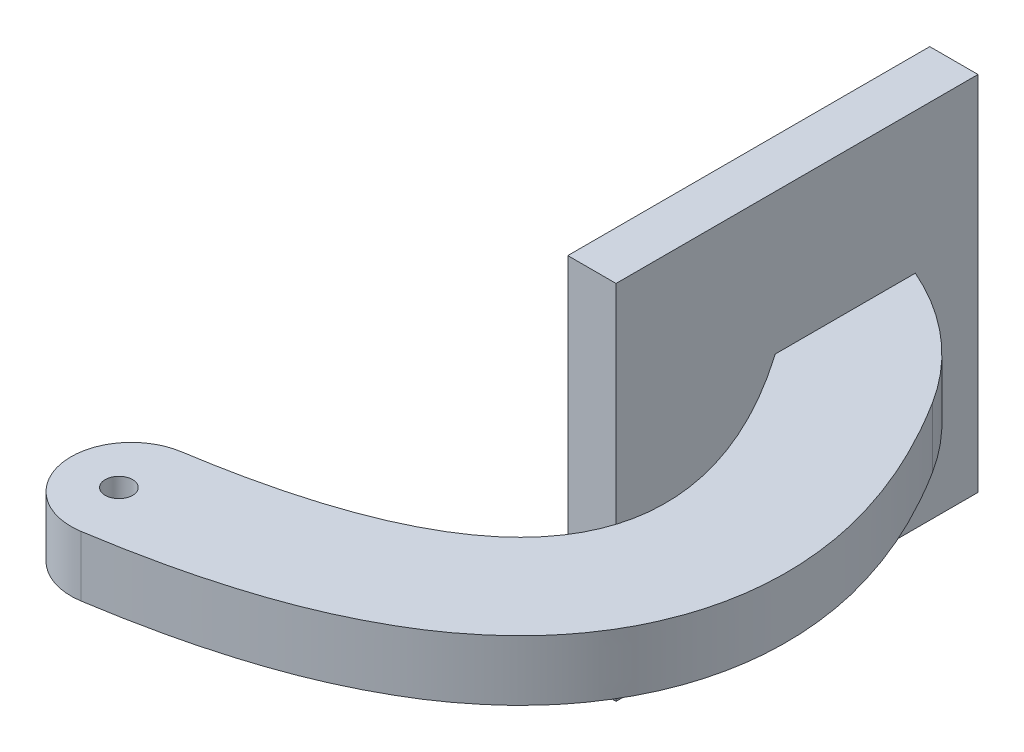
ISO-10303-21;
HEADER;
FILE_DESCRIPTION(('STEP AP214'),'2;1');
FILE_NAME('part.step','',(''),(''),'','','');
FILE_SCHEMA(('AUTOMOTIVE_DESIGN { 1 0 10303 214 1 1 1 1 }'));
ENDSEC;
DATA;
#1=APPLICATION_CONTEXT('core data for automotive mechanical design processes');
#2=APPLICATION_PROTOCOL_DEFINITION('international standard','automotive_design',2000,#1);
#3=PRODUCT_CONTEXT('',#1,'mechanical');
#4=PRODUCT('Part','Part','',(#3));
#5=PRODUCT_RELATED_PRODUCT_CATEGORY('part','',(#4));
#6=PRODUCT_DEFINITION_FORMATION('','',#4);
#7=PRODUCT_DEFINITION_CONTEXT('part definition',#1,'design');
#8=PRODUCT_DEFINITION('design','',#6,#7);
#9=PRODUCT_DEFINITION_SHAPE('','',#8);
#10=(LENGTH_UNIT() NAMED_UNIT(*) SI_UNIT(.MILLI.,.METRE.));
#11=(NAMED_UNIT(*) PLANE_ANGLE_UNIT() SI_UNIT($,.RADIAN.));
#12=(NAMED_UNIT(*) SI_UNIT($,.STERADIAN.) SOLID_ANGLE_UNIT());
#13=UNCERTAINTY_MEASURE_WITH_UNIT(LENGTH_MEASURE(1.E-05),#10,'distance_accuracy_value','');
#14=(GEOMETRIC_REPRESENTATION_CONTEXT(3) GLOBAL_UNCERTAINTY_ASSIGNED_CONTEXT((#13)) GLOBAL_UNIT_ASSIGNED_CONTEXT((#10,
#11,#12)) REPRESENTATION_CONTEXT('',''));
#15=CARTESIAN_POINT('',(0.,0.,0.));
#16=DIRECTION('',(0.,0.,1.));
#17=DIRECTION('',(1.,0.,0.));
#18=AXIS2_PLACEMENT_3D('',#15,#16,#17);
#19=CARTESIAN_POINT('',(12.2998460553788,-2.5,-15.4348897196174));
#20=CARTESIAN_POINT('',(30.5340209937318,-2.5,10.6094243612834));
#21=CARTESIAN_POINT('',(-5.28178022993747,-2.5,16.1860117987063));
#22=B_SPLINE_CURVE_WITH_KNOTS('',2,(#19,#20,#21),.UNSPECIFIED.,.F.,.F.,(3,3),(0.,1.),.UNSPECIFIED.);
#23=DIRECTION('',(0.,1.,0.));
#24=VECTOR('',#23,1.);
#25=SURFACE_OF_LINEAR_EXTRUSION('',#22,#24);
#26=DIRECTION('',(0.,1.,0.));
#27=VECTOR('',#26,1.);
#28=CARTESIAN_POINT('',(-5.28178022993747,-2.5,16.1860117987063));
#29=LINE('',#28,#27);
#30=CARTESIAN_POINT('',(-5.28178022993747,-2.5,16.1860117987063));
#31=VERTEX_POINT('',#30);
#32=CARTESIAN_POINT('',(-5.28178022993747,2.5,16.1860117987063));
#33=VERTEX_POINT('',#32);
#34=EDGE_CURVE('E38',#31,#33,#29,.T.);
#35=ORIENTED_EDGE('',*,*,#34,.T.);
#36=CARTESIAN_POINT('',(12.2998460553788,2.5,-15.4348897196174));
#37=CARTESIAN_POINT('',(30.5340209937318,2.5,10.6094243612834));
#38=CARTESIAN_POINT('',(-5.28178022993747,2.5,16.1860117987063));
#39=B_SPLINE_CURVE_WITH_KNOTS('',2,(#36,#37,#38),.UNSPECIFIED.,.F.,.F.,(3,3),(0.,1.),.UNSPECIFIED.);
#40=CARTESIAN_POINT('',(12.2998460553788,2.5,-15.4348897196174));
#41=VERTEX_POINT('',#40);
#42=EDGE_CURVE('E133',#41,#33,#39,.T.);
#43=ORIENTED_EDGE('',*,*,#42,.F.);
#44=DIRECTION('',(0.,1.,0.));
#45=VECTOR('',#44,1.);
#46=CARTESIAN_POINT('',(12.2998460553788,-2.5,-15.4348897196174));
#47=LINE('',#46,#45);
#48=CARTESIAN_POINT('',(12.2998460553788,-2.5,-15.4348897196174));
#49=VERTEX_POINT('',#48);
#50=EDGE_CURVE('E11',#49,#41,#47,.T.);
#51=ORIENTED_EDGE('',*,*,#50,.F.);
#52=EDGE_CURVE('E162',#49,#31,#22,.T.);
#53=ORIENTED_EDGE('',*,*,#52,.T.);
#54=EDGE_LOOP('',(#35,#43,#51,#53));
#55=FACE_BOUND('',#54,.T.);
#56=ADVANCED_FACE('F34',(#55),#25,.T.);
#57=CARTESIAN_POINT('',(3.36644101936229,-2.5,-6.50084250987972));
#58=DIRECTION('',(0.,1.,0.));
#59=DIRECTION('',(0.,0.,1.));
#60=AXIS2_PLACEMENT_3D('',#57,#58,#59);
#61=CYLINDRICAL_SURFACE('',#60,22.4003979095357);
#62=DIRECTION('',(0.,1.,0.));
#63=VECTOR('',#62,1.);
#64=CARTESIAN_POINT('',(12.2998460553788,-2.5,-27.0428020310161));
#65=LINE('',#64,#63);
#66=CARTESIAN_POINT('',(12.2998460553788,-2.5,-27.0428020310161));
#67=VERTEX_POINT('',#66);
#68=CARTESIAN_POINT('',(12.2998460553788,2.5,-27.0428020310161));
#69=VERTEX_POINT('',#68);
#70=EDGE_CURVE('E43',#67,#69,#65,.T.);
#71=ORIENTED_EDGE('',*,*,#70,.T.);
#72=CARTESIAN_POINT('',(3.36644101936229,2.5,-6.50084250987972));
#73=DIRECTION('',(0.,1.,0.));
#74=DIRECTION('',(0.,0.,1.));
#75=AXIS2_PLACEMENT_3D('',#72,#73,#74);
#76=CIRCLE('',#75,22.4003979095357);
#77=CARTESIAN_POINT('',(22.3170477174932,2.5,-18.4445576889305));
#78=VERTEX_POINT('',#77);
#79=EDGE_CURVE('E154',#78,#69,#76,.T.);
#80=ORIENTED_EDGE('',*,*,#79,.F.);
#81=DIRECTION('',(0.,1.,0.));
#82=VECTOR('',#81,1.);
#83=CARTESIAN_POINT('',(22.3170477174932,-2.5,-18.4445576889305));
#84=LINE('',#83,#82);
#85=CARTESIAN_POINT('',(22.3170477174932,-2.5,-18.4445576889305));
#86=VERTEX_POINT('',#85);
#87=EDGE_CURVE('E51',#86,#78,#84,.T.);
#88=ORIENTED_EDGE('',*,*,#87,.F.);
#89=CARTESIAN_POINT('',(3.36644101936229,-2.5,-6.50084250987972));
#90=DIRECTION('',(0.,1.,0.));
#91=DIRECTION('',(0.,0.,1.));
#92=AXIS2_PLACEMENT_3D('',#89,#90,#91);
#93=CIRCLE('',#92,22.4003979095357);
#94=EDGE_CURVE('E179',#86,#67,#93,.T.);
#95=ORIENTED_EDGE('',*,*,#94,.T.);
#96=EDGE_LOOP('',(#71,#80,#88,#95));
#97=FACE_BOUND('',#96,.T.);
#98=ADVANCED_FACE('F189',(#97),#61,.T.);
#99=CARTESIAN_POINT('',(-3.74802363914334,-2.5,26.0676906135159));
#100=CARTESIAN_POINT('',(-0.197461384008946,-2.5,25.5179857325844));
#101=CARTESIAN_POINT('',(6.2320549815198,-2.5,23.9837519705872));
#102=CARTESIAN_POINT('',(13.0095204848105,-2.5,21.6106162649933));
#103=CARTESIAN_POINT('',(18.9084588451238,-2.5,18.1554664202967));
#104=CARTESIAN_POINT('',(22.5532910735824,-2.5,14.8575619863981));
#105=CARTESIAN_POINT('',(25.0390048293062,-2.5,11.7200829509025));
#106=CARTESIAN_POINT('',(26.9375809552057,-2.5,8.12412148420165));
#107=CARTESIAN_POINT('',(28.1120950374525,-2.5,4.22135214565225));
#108=CARTESIAN_POINT('',(28.5309802057236,-2.5,0.219774719061888));
#109=CARTESIAN_POINT('',(28.1991355787615,-2.5,-4.70608306993397));
#110=CARTESIAN_POINT('',(26.568030041585,-2.5,-10.3292004159706));
#111=CARTESIAN_POINT('',(24.0109872483326,-2.5,-15.7568527882259));
#112=CARTESIAN_POINT('',(22.3170477174932,-2.5,-18.4445576889305));
#113=B_SPLINE_CURVE_WITH_KNOTS('',2,(#99,#100,#101,#102,#103,#104,#105,#106,#107,#108,#109,#110,
#111,#112),.UNSPECIFIED.,.F.,.F.,(3,1,1,1,1,1,1,1,1,1,1,1,3),(0.0450255525819947,
0.134554407027433,0.224083261472871,0.343455067400121,0.432983921845559,0.492669824809185,
0.55235572777281,0.612041630736435,0.671727533700061,0.731413436663686,0.820942291109124,
0.910471145554562,1.),.UNSPECIFIED.);
#114=DIRECTION('',(0.,1.,0.));
#115=VECTOR('',#114,1.);
#116=SURFACE_OF_LINEAR_EXTRUSION('',#113,#115);
#117=ORIENTED_EDGE('',*,*,#87,.T.);
#118=CARTESIAN_POINT('',(-3.74802363914334,2.5,26.0676906135159));
#119=CARTESIAN_POINT('',(-0.197461384008946,2.5,25.5179857325844));
#120=CARTESIAN_POINT('',(6.2320549815198,2.5,23.9837519705872));
#121=CARTESIAN_POINT('',(13.0095204848105,2.5,21.6106162649933));
#122=CARTESIAN_POINT('',(18.9084588451238,2.5,18.1554664202967));
#123=CARTESIAN_POINT('',(22.5532910735824,2.5,14.8575619863981));
#124=CARTESIAN_POINT('',(25.0390048293062,2.5,11.7200829509025));
#125=CARTESIAN_POINT('',(26.9375809552057,2.5,8.12412148420165));
#126=CARTESIAN_POINT('',(28.1120950374525,2.5,4.22135214565225));
#127=CARTESIAN_POINT('',(28.5309802057236,2.5,0.219774719061888));
#128=CARTESIAN_POINT('',(28.1991355787615,2.5,-4.70608306993397));
#129=CARTESIAN_POINT('',(26.568030041585,2.5,-10.3292004159706));
#130=CARTESIAN_POINT('',(24.0109872483326,2.5,-15.7568527882259));
#131=CARTESIAN_POINT('',(22.3170477174932,2.5,-18.4445576889305));
#132=B_SPLINE_CURVE_WITH_KNOTS('',2,(#118,#119,#120,#121,#122,#123,#124,#125,#126,#127,#128,
#129,#130,#131),.UNSPECIFIED.,.F.,.F.,(3,1,1,1,1,1,1,1,1,1,1,1,3),(0.0450255525819947,
0.134554407027433,0.224083261472871,0.343455067400121,0.432983921845559,0.492669824809185,
0.55235572777281,0.612041630736435,0.671727533700061,0.731413436663686,0.820942291109124,
0.910471145554562,1.),.UNSPECIFIED.);
#133=CARTESIAN_POINT('',(-3.74802363914334,2.5,26.0676906135159));
#134=VERTEX_POINT('',#133);
#135=EDGE_CURVE('E149',#134,#78,#132,.T.);
#136=ORIENTED_EDGE('',*,*,#135,.F.);
#137=DIRECTION('',(0.,1.,0.));
#138=VECTOR('',#137,1.);
#139=CARTESIAN_POINT('',(-3.74802363914334,-2.5,26.0676906135159));
#140=LINE('',#139,#138);
#141=CARTESIAN_POINT('',(-3.74802363914334,-2.5,26.0676906135159));
#142=VERTEX_POINT('',#141);
#143=EDGE_CURVE('E59',#142,#134,#140,.T.);
#144=ORIENTED_EDGE('',*,*,#143,.F.);
#145=EDGE_CURVE('E174',#142,#86,#113,.T.);
#146=ORIENTED_EDGE('',*,*,#145,.T.);
#147=EDGE_LOOP('',(#117,#136,#144,#146));
#148=FACE_BOUND('',#147,.T.);
#149=ADVANCED_FACE('F185',(#148),#116,.T.);
#150=CARTESIAN_POINT('',(-4.51490193454041,-2.5,21.1268512061111));
#151=DIRECTION('',(0.,1.,0.));
#152=DIRECTION('',(0.,0.,1.));
#153=AXIS2_PLACEMENT_3D('',#150,#151,#152);
#154=CYLINDRICAL_SURFACE('',#153,4.99999963697155);
#155=ORIENTED_EDGE('',*,*,#143,.T.);
#156=CARTESIAN_POINT('',(-4.51490193454041,2.5,21.1268512061111));
#157=DIRECTION('',(0.,1.,0.));
#158=DIRECTION('',(0.,0.,-1.));
#159=AXIS2_PLACEMENT_3D('',#156,#157,#158);
#160=CIRCLE('',#159,4.99999963697155);
#161=EDGE_CURVE('E136',#33,#134,#160,.T.);
#162=ORIENTED_EDGE('',*,*,#161,.F.);
#163=ORIENTED_EDGE('',*,*,#34,.F.);
#164=CARTESIAN_POINT('',(-4.51490193454041,-2.5,21.1268512061111));
#165=DIRECTION('',(0.,1.,0.));
#166=DIRECTION('',(0.,0.,-1.));
#167=AXIS2_PLACEMENT_3D('',#164,#165,#166);
#168=CIRCLE('',#167,4.99999963697155);
#169=EDGE_CURVE('E168',#31,#142,#168,.T.);
#170=ORIENTED_EDGE('',*,*,#169,.T.);
#171=EDGE_LOOP('',(#155,#162,#163,#170));
#172=FACE_BOUND('',#171,.T.);
#173=ADVANCED_FACE('F188',(#172),#154,.T.);
#174=CARTESIAN_POINT('',(17.0215269532262,-2.5,5.4924927004139));
#175=DIRECTION('',(0.,1.,0.));
#176=DIRECTION('',(0.,0.,1.));
#177=AXIS2_PLACEMENT_3D('',#174,#175,#176);
#178=PLANE('',#177);
#179=CARTESIAN_POINT('',(-5.32341486702137,-2.5,21.3457461869631));
#180=DIRECTION('',(0.,1.,0.));
#181=DIRECTION('',(0.,0.,1.));
#182=AXIS2_PLACEMENT_3D('',#179,#180,#181);
#183=CIRCLE('',#182,1.13589911686361);
#184=CARTESIAN_POINT('',(-5.32341486702137,-2.5,22.4816453038267));
#185=VERTEX_POINT('',#184);
#186=EDGE_CURVE('E328',#185,#185,#183,.F.);
#187=ORIENTED_EDGE('',*,*,#186,.F.);
#188=EDGE_LOOP('',(#187));
#189=FACE_BOUND('',#188,.T.);
#190=ORIENTED_EDGE('',*,*,#52,.F.);
#191=DIRECTION('',(0.,0.,1.));
#192=VECTOR('',#191,1.);
#193=CARTESIAN_POINT('',(12.2998460553788,-2.5,-27.0428020310161));
#194=LINE('',#193,#192);
#195=EDGE_CURVE('E207',#67,#49,#194,.T.);
#196=ORIENTED_EDGE('',*,*,#195,.F.);
#197=ORIENTED_EDGE('',*,*,#94,.F.);
#198=ORIENTED_EDGE('',*,*,#145,.F.);
#199=ORIENTED_EDGE('',*,*,#169,.F.);
#200=EDGE_LOOP('',(#190,#196,#197,#198,#199));
#201=FACE_BOUND('',#200,.T.);
#202=ADVANCED_FACE('F192',(#189,#201),#178,.F.);
#203=CARTESIAN_POINT('',(17.0215269532262,2.5,5.4924927004139));
#204=DIRECTION('',(0.,1.,0.));
#205=DIRECTION('',(0.,0.,1.));
#206=AXIS2_PLACEMENT_3D('',#203,#204,#205);
#207=PLANE('',#206);
#208=CARTESIAN_POINT('',(-5.32341486702137,2.5,21.3457461869631));
#209=DIRECTION('',(0.,-1.,0.));
#210=DIRECTION('',(0.,0.,-1.));
#211=AXIS2_PLACEMENT_3D('',#208,#209,#210);
#212=CIRCLE('',#211,1.13589911686361);
#213=CARTESIAN_POINT('',(-5.32341486702137,2.5,20.2098470700994));
#214=VERTEX_POINT('',#213);
#215=EDGE_CURVE('E325',#214,#214,#212,.T.);
#216=ORIENTED_EDGE('',*,*,#215,.T.);
#217=EDGE_LOOP('',(#216));
#218=FACE_BOUND('',#217,.T.);
#219=ORIENTED_EDGE('',*,*,#42,.T.);
#220=ORIENTED_EDGE('',*,*,#161,.T.);
#221=ORIENTED_EDGE('',*,*,#135,.T.);
#222=ORIENTED_EDGE('',*,*,#79,.T.);
#223=DIRECTION('',(0.,0.,1.));
#224=VECTOR('',#223,1.);
#225=CARTESIAN_POINT('',(12.2998460553788,2.5,-27.0428020310161));
#226=LINE('',#225,#224);
#227=EDGE_CURVE('E160',#69,#41,#226,.T.);
#228=ORIENTED_EDGE('',*,*,#227,.T.);
#229=EDGE_LOOP('',(#219,#220,#221,#222,#228));
#230=FACE_BOUND('',#229,.T.);
#231=ADVANCED_FACE('F196',(#218,#230),#207,.T.);
#232=CARTESIAN_POINT('',(12.2998460553788,0.,0.));
#233=DIRECTION('',(1.,0.,0.));
#234=DIRECTION('',(0.,0.,-1.));
#235=AXIS2_PLACEMENT_3D('',#232,#233,#234);
#236=PLANE('',#235);
#237=DIRECTION('',(0.,-1.,0.));
#238=VECTOR('',#237,1.);
#239=CARTESIAN_POINT('',(12.2998460553788,-15.8343973694878,-32.2368676619499));
#240=LINE('',#239,#238);
#241=CARTESIAN_POINT('',(12.2998460553788,14.1656026305122,-32.2368676619499));
#242=VERTEX_POINT('',#241);
#243=CARTESIAN_POINT('',(12.2998460553788,-15.8343973694878,-32.2368676619499));
#244=VERTEX_POINT('',#243);
#245=EDGE_CURVE('E132',#242,#244,#240,.T.);
#246=ORIENTED_EDGE('',*,*,#245,.F.);
#247=DIRECTION('',(0.,0.,-1.));
#248=VECTOR('',#247,1.);
#249=CARTESIAN_POINT('',(12.2998460553788,14.1656026305122,-32.2368676619499));
#250=LINE('',#249,#248);
#251=CARTESIAN_POINT('',(12.2998460553788,14.1656026305122,-2.23686766194988));
#252=VERTEX_POINT('',#251);
#253=EDGE_CURVE('E128',#252,#242,#250,.T.);
#254=ORIENTED_EDGE('',*,*,#253,.F.);
#255=DIRECTION('',(0.,1.,0.));
#256=VECTOR('',#255,1.);
#257=CARTESIAN_POINT('',(12.2998460553788,-15.8343973694878,-2.23686766194988));
#258=LINE('',#257,#256);
#259=CARTESIAN_POINT('',(12.2998460553788,-15.8343973694878,-2.23686766194988));
#260=VERTEX_POINT('',#259);
#261=EDGE_CURVE('E338',#260,#252,#258,.T.);
#262=ORIENTED_EDGE('',*,*,#261,.F.);
#263=DIRECTION('',(0.,0.,1.));
#264=VECTOR('',#263,1.);
#265=CARTESIAN_POINT('',(12.2998460553788,-15.8343973694878,-32.2368676619499));
#266=LINE('',#265,#264);
#267=EDGE_CURVE('E330',#244,#260,#266,.T.);
#268=ORIENTED_EDGE('',*,*,#267,.F.);
#269=EDGE_LOOP('',(#246,#254,#262,#268));
#270=FACE_BOUND('',#269,.T.);
#271=ORIENTED_EDGE('',*,*,#195,.T.);
#272=ORIENTED_EDGE('',*,*,#50,.T.);
#273=ORIENTED_EDGE('',*,*,#227,.F.);
#274=ORIENTED_EDGE('',*,*,#70,.F.);
#275=EDGE_LOOP('',(#271,#272,#273,#274));
#276=FACE_BOUND('',#275,.T.);
#277=ADVANCED_FACE('F211',(#270,#276),#236,.T.);
#278=CARTESIAN_POINT('',(8.29984605537879,-15.8343973694878,-32.2368676619499));
#279=DIRECTION('',(0.,0.,1.));
#280=DIRECTION('',(1.,0.,0.));
#281=AXIS2_PLACEMENT_3D('',#278,#279,#280);
#282=PLANE('',#281);
#283=ORIENTED_EDGE('',*,*,#245,.T.);
#284=DIRECTION('',(1.,0.,0.));
#285=VECTOR('',#284,1.);
#286=CARTESIAN_POINT('',(8.29984605537879,-15.8343973694878,-32.2368676619499));
#287=LINE('',#286,#285);
#288=CARTESIAN_POINT('',(8.29984605537879,-15.8343973694878,-32.2368676619499));
#289=VERTEX_POINT('',#288);
#290=EDGE_CURVE('E112',#289,#244,#287,.T.);
#291=ORIENTED_EDGE('',*,*,#290,.F.);
#292=DIRECTION('',(0.,-1.,0.));
#293=VECTOR('',#292,1.);
#294=CARTESIAN_POINT('',(8.29984605537879,-15.8343973694878,-32.2368676619499));
#295=LINE('',#294,#293);
#296=CARTESIAN_POINT('',(8.29984605537879,14.1656026305122,-32.2368676619499));
#297=VERTEX_POINT('',#296);
#298=EDGE_CURVE('E119',#297,#289,#295,.T.);
#299=ORIENTED_EDGE('',*,*,#298,.F.);
#300=DIRECTION('',(1.,0.,0.));
#301=VECTOR('',#300,1.);
#302=CARTESIAN_POINT('',(8.29984605537879,14.1656026305122,-32.2368676619499));
#303=LINE('',#302,#301);
#304=EDGE_CURVE('E335',#297,#242,#303,.T.);
#305=ORIENTED_EDGE('',*,*,#304,.T.);
#306=EDGE_LOOP('',(#283,#291,#299,#305));
#307=FACE_BOUND('',#306,.T.);
#308=ADVANCED_FACE('F130',(#307),#282,.F.);
#309=CARTESIAN_POINT('',(8.29984605537879,-15.8343973694878,-32.2368676619499));
#310=DIRECTION('',(0.,1.,0.));
#311=DIRECTION('',(0.,0.,1.));
#312=AXIS2_PLACEMENT_3D('',#309,#310,#311);
#313=PLANE('',#312);
#314=ORIENTED_EDGE('',*,*,#267,.T.);
#315=DIRECTION('',(1.,0.,0.));
#316=VECTOR('',#315,1.);
#317=CARTESIAN_POINT('',(8.29984605537879,-15.8343973694878,-2.23686766194988));
#318=LINE('',#317,#316);
#319=CARTESIAN_POINT('',(8.29984605537879,-15.8343973694878,-2.23686766194988));
#320=VERTEX_POINT('',#319);
#321=EDGE_CURVE('E115',#320,#260,#318,.T.);
#322=ORIENTED_EDGE('',*,*,#321,.F.);
#323=DIRECTION('',(0.,0.,1.));
#324=VECTOR('',#323,1.);
#325=CARTESIAN_POINT('',(8.29984605537879,-15.8343973694878,-32.2368676619499));
#326=LINE('',#325,#324);
#327=EDGE_CURVE('E108',#289,#320,#326,.T.);
#328=ORIENTED_EDGE('',*,*,#327,.F.);
#329=ORIENTED_EDGE('',*,*,#290,.T.);
#330=EDGE_LOOP('',(#314,#322,#328,#329));
#331=FACE_BOUND('',#330,.T.);
#332=ADVANCED_FACE('F110',(#331),#313,.F.);
#333=CARTESIAN_POINT('',(8.29984605537879,-15.8343973694878,-2.23686766194988));
#334=DIRECTION('',(0.,0.,-1.));
#335=DIRECTION('',(-1.,0.,0.));
#336=AXIS2_PLACEMENT_3D('',#333,#334,#335);
#337=PLANE('',#336);
#338=ORIENTED_EDGE('',*,*,#261,.T.);
#339=DIRECTION('',(1.,0.,0.));
#340=VECTOR('',#339,1.);
#341=CARTESIAN_POINT('',(8.29984605537879,14.1656026305122,-2.23686766194988));
#342=LINE('',#341,#340);
#343=CARTESIAN_POINT('',(8.29984605537879,14.1656026305122,-2.23686766194988));
#344=VERTEX_POINT('',#343);
#345=EDGE_CURVE('E138',#344,#252,#342,.T.);
#346=ORIENTED_EDGE('',*,*,#345,.F.);
#347=DIRECTION('',(0.,1.,0.));
#348=VECTOR('',#347,1.);
#349=CARTESIAN_POINT('',(8.29984605537879,-15.8343973694878,-2.23686766194988));
#350=LINE('',#349,#348);
#351=EDGE_CURVE('E118',#320,#344,#350,.T.);
#352=ORIENTED_EDGE('',*,*,#351,.F.);
#353=ORIENTED_EDGE('',*,*,#321,.T.);
#354=EDGE_LOOP('',(#338,#346,#352,#353));
#355=FACE_BOUND('',#354,.T.);
#356=ADVANCED_FACE('F233',(#355),#337,.F.);
#357=CARTESIAN_POINT('',(8.29984605537879,14.1656026305122,-32.2368676619499));
#358=DIRECTION('',(0.,-1.,0.));
#359=DIRECTION('',(0.,0.,-1.));
#360=AXIS2_PLACEMENT_3D('',#357,#358,#359);
#361=PLANE('',#360);
#362=ORIENTED_EDGE('',*,*,#253,.T.);
#363=ORIENTED_EDGE('',*,*,#304,.F.);
#364=DIRECTION('',(0.,0.,-1.));
#365=VECTOR('',#364,1.);
#366=CARTESIAN_POINT('',(8.29984605537879,14.1656026305122,-32.2368676619499));
#367=LINE('',#366,#365);
#368=EDGE_CURVE('E124',#344,#297,#367,.T.);
#369=ORIENTED_EDGE('',*,*,#368,.F.);
#370=ORIENTED_EDGE('',*,*,#345,.T.);
#371=EDGE_LOOP('',(#362,#363,#369,#370));
#372=FACE_BOUND('',#371,.T.);
#373=ADVANCED_FACE('F230',(#372),#361,.F.);
#374=CARTESIAN_POINT('',(8.29984605537879,0.,0.));
#375=DIRECTION('',(1.,0.,0.));
#376=DIRECTION('',(0.,0.,-1.));
#377=AXIS2_PLACEMENT_3D('',#374,#375,#376);
#378=PLANE('',#377);
#379=ORIENTED_EDGE('',*,*,#298,.T.);
#380=ORIENTED_EDGE('',*,*,#327,.T.);
#381=ORIENTED_EDGE('',*,*,#351,.T.);
#382=ORIENTED_EDGE('',*,*,#368,.T.);
#383=EDGE_LOOP('',(#379,#380,#381,#382));
#384=FACE_BOUND('',#383,.T.);
#385=ADVANCED_FACE('F122',(#384),#378,.F.);
#386=CARTESIAN_POINT('',(-5.32341486702137,-15.8343973694878,21.3457461869631));
#387=DIRECTION('',(0.,1.,0.));
#388=DIRECTION('',(0.,0.,1.));
#389=AXIS2_PLACEMENT_3D('',#386,#387,#388);
#390=CYLINDRICAL_SURFACE('',#389,1.13589911686361);
#391=ORIENTED_EDGE('',*,*,#215,.F.);
#392=EDGE_LOOP('',(#391));
#393=FACE_BOUND('',#392,.T.);
#394=ORIENTED_EDGE('',*,*,#186,.T.);
#395=EDGE_LOOP('',(#394));
#396=FACE_BOUND('',#395,.T.);
#397=ADVANCED_FACE('F257',(#393,#396),#390,.F.);
#398=CLOSED_SHELL('',(#56,#98,#149,#173,#202,#231,#277,#308,#332,#356,#373,#385,#397));
#399=MANIFOLD_SOLID_BREP('B2',#398);
#400=ADVANCED_BREP_SHAPE_REPRESENTATION('',(#18,#399),#14);
#401=SHAPE_DEFINITION_REPRESENTATION(#9,#400);
ENDSEC;
END-ISO-10303-21;
